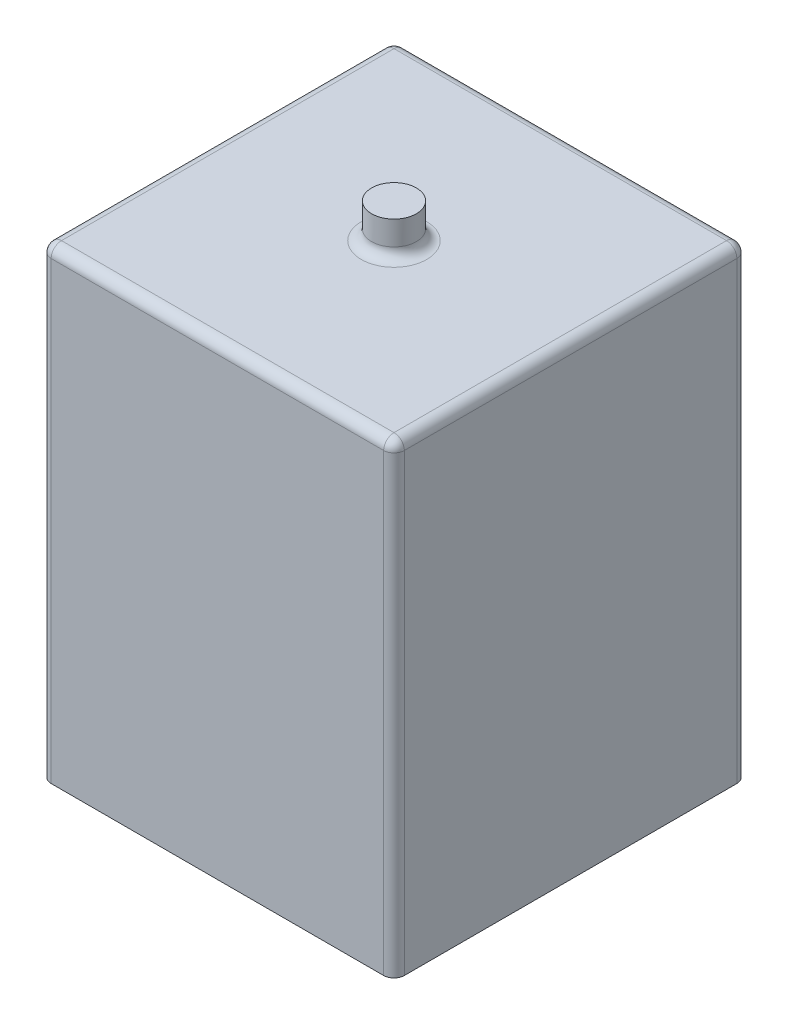
ISO-10303-21;
HEADER;
FILE_DESCRIPTION(('STEP AP214'),'2;1');
FILE_NAME('part.step','',(''),(''),'','','');
FILE_SCHEMA(('AUTOMOTIVE_DESIGN { 1 0 10303 214 1 1 1 1 }'));
ENDSEC;
DATA;
#1=APPLICATION_CONTEXT('core data for automotive mechanical design processes');
#2=APPLICATION_PROTOCOL_DEFINITION('international standard','automotive_design',2000,#1);
#3=PRODUCT_CONTEXT('',#1,'mechanical');
#4=PRODUCT('Part','Part','',(#3));
#5=PRODUCT_RELATED_PRODUCT_CATEGORY('part','',(#4));
#6=PRODUCT_DEFINITION_FORMATION('','',#4);
#7=PRODUCT_DEFINITION_CONTEXT('part definition',#1,'design');
#8=PRODUCT_DEFINITION('design','',#6,#7);
#9=PRODUCT_DEFINITION_SHAPE('','',#8);
#10=(LENGTH_UNIT() NAMED_UNIT(*) SI_UNIT(.MILLI.,.METRE.));
#11=(NAMED_UNIT(*) PLANE_ANGLE_UNIT() SI_UNIT($,.RADIAN.));
#12=(NAMED_UNIT(*) SI_UNIT($,.STERADIAN.) SOLID_ANGLE_UNIT());
#13=UNCERTAINTY_MEASURE_WITH_UNIT(LENGTH_MEASURE(1.E-05),#10,'distance_accuracy_value','');
#14=(GEOMETRIC_REPRESENTATION_CONTEXT(3) GLOBAL_UNCERTAINTY_ASSIGNED_CONTEXT((#13)) GLOBAL_UNIT_ASSIGNED_CONTEXT((#10,
#11,#12)) REPRESENTATION_CONTEXT('',''));
#15=CARTESIAN_POINT('',(0.,0.,0.));
#16=DIRECTION('',(0.,0.,1.));
#17=DIRECTION('',(1.,0.,0.));
#18=AXIS2_PLACEMENT_3D('',#15,#16,#17);
#19=CARTESIAN_POINT('',(5.12652416360247,13.5,5.12652416360247));
#20=DIRECTION('',(-1.,0.,0.));
#21=DIRECTION('',(0.,0.,1.));
#22=AXIS2_PLACEMENT_3D('',#19,#20,#21);
#23=PLANE('',#22);
#24=DIRECTION('',(0.,0.,-1.));
#25=VECTOR('',#24,1.);
#26=CARTESIAN_POINT('',(5.12652416360247,0.,5.12652416360247));
#27=LINE('',#26,#25);
#28=CARTESIAN_POINT('',(5.12652416360247,0.,4.82652416360247));
#29=VERTEX_POINT('',#28);
#30=CARTESIAN_POINT('',(5.12652416360247,0.,-4.82652416360247));
#31=VERTEX_POINT('',#30);
#32=EDGE_CURVE('E205',#29,#31,#27,.T.);
#33=ORIENTED_EDGE('',*,*,#32,.T.);
#34=DIRECTION('',(0.,-1.,0.));
#35=VECTOR('',#34,1.);
#36=CARTESIAN_POINT('',(5.12652416360247,13.5,-4.82652416360247));
#37=LINE('',#36,#35);
#38=CARTESIAN_POINT('',(5.12652416360247,13.2,-4.82652416360247));
#39=VERTEX_POINT('',#38);
#40=EDGE_CURVE('E50',#31,#39,#37,.F.);
#41=ORIENTED_EDGE('',*,*,#40,.T.);
#42=DIRECTION('',(0.,0.,-1.));
#43=VECTOR('',#42,1.);
#44=CARTESIAN_POINT('',(5.12652416360247,13.2,5.12652416360247));
#45=LINE('',#44,#43);
#46=CARTESIAN_POINT('',(5.12652416360247,13.2,4.82652416360247));
#47=VERTEX_POINT('',#46);
#48=EDGE_CURVE('E55',#39,#47,#45,.F.);
#49=ORIENTED_EDGE('',*,*,#48,.T.);
#50=DIRECTION('',(0.,-1.,0.));
#51=VECTOR('',#50,1.);
#52=CARTESIAN_POINT('',(5.12652416360247,13.5,4.82652416360247));
#53=LINE('',#52,#51);
#54=EDGE_CURVE('E168',#47,#29,#53,.T.);
#55=ORIENTED_EDGE('',*,*,#54,.T.);
#56=EDGE_LOOP('',(#33,#41,#49,#55));
#57=FACE_BOUND('',#56,.T.);
#58=ADVANCED_FACE('F33',(#57),#23,.F.);
#59=CARTESIAN_POINT('',(-5.12652416360247,13.5,-5.12652416360247));
#60=DIRECTION('',(0.,0.,1.));
#61=DIRECTION('',(1.,0.,0.));
#62=AXIS2_PLACEMENT_3D('',#59,#60,#61);
#63=PLANE('',#62);
#64=DIRECTION('',(-1.,0.,0.));
#65=VECTOR('',#64,1.);
#66=CARTESIAN_POINT('',(-5.12652416360247,0.,-5.12652416360247));
#67=LINE('',#66,#65);
#68=CARTESIAN_POINT('',(4.82652416360247,0.,-5.12652416360247));
#69=VERTEX_POINT('',#68);
#70=CARTESIAN_POINT('',(-4.82652416360247,0.,-5.12652416360247));
#71=VERTEX_POINT('',#70);
#72=EDGE_CURVE('E209',#69,#71,#67,.T.);
#73=ORIENTED_EDGE('',*,*,#72,.T.);
#74=DIRECTION('',(0.,-1.,0.));
#75=VECTOR('',#74,1.);
#76=CARTESIAN_POINT('',(-4.82652416360247,13.5,-5.12652416360247));
#77=LINE('',#76,#75);
#78=CARTESIAN_POINT('',(-4.82652416360247,13.2,-5.12652416360247));
#79=VERTEX_POINT('',#78);
#80=EDGE_CURVE('E166',#71,#79,#77,.F.);
#81=ORIENTED_EDGE('',*,*,#80,.T.);
#82=DIRECTION('',(-1.,0.,0.));
#83=VECTOR('',#82,1.);
#84=CARTESIAN_POINT('',(-5.12652416360247,13.2,-5.12652416360247));
#85=LINE('',#84,#83);
#86=CARTESIAN_POINT('',(4.82652416360247,13.2,-5.12652416360247));
#87=VERTEX_POINT('',#86);
#88=EDGE_CURVE('E164',#79,#87,#85,.F.);
#89=ORIENTED_EDGE('',*,*,#88,.T.);
#90=DIRECTION('',(0.,-1.,0.));
#91=VECTOR('',#90,1.);
#92=CARTESIAN_POINT('',(4.82652416360247,13.5,-5.12652416360247));
#93=LINE('',#92,#91);
#94=EDGE_CURVE('E162',#87,#69,#93,.T.);
#95=ORIENTED_EDGE('',*,*,#94,.T.);
#96=EDGE_LOOP('',(#73,#81,#89,#95));
#97=FACE_BOUND('',#96,.T.);
#98=ADVANCED_FACE('F264',(#97),#63,.F.);
#99=CARTESIAN_POINT('',(-5.12652416360247,13.5,5.12652416360247));
#100=DIRECTION('',(1.,0.,0.));
#101=DIRECTION('',(0.,0.,-1.));
#102=AXIS2_PLACEMENT_3D('',#99,#100,#101);
#103=PLANE('',#102);
#104=DIRECTION('',(0.,0.,1.));
#105=VECTOR('',#104,1.);
#106=CARTESIAN_POINT('',(-5.12652416360247,0.,5.12652416360247));
#107=LINE('',#106,#105);
#108=CARTESIAN_POINT('',(-5.12652416360247,0.,-4.82652416360247));
#109=VERTEX_POINT('',#108);
#110=CARTESIAN_POINT('',(-5.12652416360247,0.,4.82652416360247));
#111=VERTEX_POINT('',#110);
#112=EDGE_CURVE('E214',#109,#111,#107,.T.);
#113=ORIENTED_EDGE('',*,*,#112,.T.);
#114=DIRECTION('',(0.,-1.,0.));
#115=VECTOR('',#114,1.);
#116=CARTESIAN_POINT('',(-5.12652416360247,13.5,4.82652416360247));
#117=LINE('',#116,#115);
#118=CARTESIAN_POINT('',(-5.12652416360247,13.2,4.82652416360247));
#119=VERTEX_POINT('',#118);
#120=EDGE_CURVE('E160',#111,#119,#117,.F.);
#121=ORIENTED_EDGE('',*,*,#120,.T.);
#122=DIRECTION('',(0.,0.,1.));
#123=VECTOR('',#122,1.);
#124=CARTESIAN_POINT('',(-5.12652416360247,13.2,5.12652416360247));
#125=LINE('',#124,#123);
#126=CARTESIAN_POINT('',(-5.12652416360247,13.2,-4.82652416360247));
#127=VERTEX_POINT('',#126);
#128=EDGE_CURVE('E158',#119,#127,#125,.F.);
#129=ORIENTED_EDGE('',*,*,#128,.T.);
#130=DIRECTION('',(0.,-1.,0.));
#131=VECTOR('',#130,1.);
#132=CARTESIAN_POINT('',(-5.12652416360247,13.5,-4.82652416360247));
#133=LINE('',#132,#131);
#134=EDGE_CURVE('E156',#127,#109,#133,.T.);
#135=ORIENTED_EDGE('',*,*,#134,.T.);
#136=EDGE_LOOP('',(#113,#121,#129,#135));
#137=FACE_BOUND('',#136,.T.);
#138=ADVANCED_FACE('F269',(#137),#103,.F.);
#139=CARTESIAN_POINT('',(-5.12652416360247,13.5,5.12652416360247));
#140=DIRECTION('',(0.,0.,-1.));
#141=DIRECTION('',(-1.,0.,0.));
#142=AXIS2_PLACEMENT_3D('',#139,#140,#141);
#143=PLANE('',#142);
#144=DIRECTION('',(1.,0.,0.));
#145=VECTOR('',#144,1.);
#146=CARTESIAN_POINT('',(-5.12652416360247,13.2,5.12652416360247));
#147=LINE('',#146,#145);
#148=CARTESIAN_POINT('',(4.82652416360247,13.2,5.12652416360247));
#149=VERTEX_POINT('',#148);
#150=CARTESIAN_POINT('',(-4.82652416360247,13.2,5.12652416360247));
#151=VERTEX_POINT('',#150);
#152=EDGE_CURVE('E118',#149,#151,#147,.F.);
#153=ORIENTED_EDGE('',*,*,#152,.T.);
#154=DIRECTION('',(0.,-1.,0.));
#155=VECTOR('',#154,1.);
#156=CARTESIAN_POINT('',(-4.82652416360247,13.5,5.12652416360247));
#157=LINE('',#156,#155);
#158=CARTESIAN_POINT('',(-4.82652416360247,0.,5.12652416360247));
#159=VERTEX_POINT('',#158);
#160=EDGE_CURVE('E154',#151,#159,#157,.T.);
#161=ORIENTED_EDGE('',*,*,#160,.T.);
#162=DIRECTION('',(1.,0.,0.));
#163=VECTOR('',#162,1.);
#164=CARTESIAN_POINT('',(-5.12652416360247,0.,5.12652416360247));
#165=LINE('',#164,#163);
#166=CARTESIAN_POINT('',(4.82652416360247,0.,5.12652416360247));
#167=VERTEX_POINT('',#166);
#168=EDGE_CURVE('E217',#159,#167,#165,.T.);
#169=ORIENTED_EDGE('',*,*,#168,.T.);
#170=DIRECTION('',(0.,-1.,0.));
#171=VECTOR('',#170,1.);
#172=CARTESIAN_POINT('',(4.82652416360247,13.5,5.12652416360247));
#173=LINE('',#172,#171);
#174=EDGE_CURVE('E147',#167,#149,#173,.F.);
#175=ORIENTED_EDGE('',*,*,#174,.T.);
#176=EDGE_LOOP('',(#153,#161,#169,#175));
#177=FACE_BOUND('',#176,.T.);
#178=ADVANCED_FACE('F240',(#177),#143,.F.);
#179=CARTESIAN_POINT('',(0.,13.5,0.));
#180=DIRECTION('',(0.,-1.,0.));
#181=DIRECTION('',(0.,0.,-1.));
#182=AXIS2_PLACEMENT_3D('',#179,#180,#181);
#183=PLANE('',#182);
#184=DIRECTION('',(0.,0.,1.));
#185=VECTOR('',#184,1.);
#186=CARTESIAN_POINT('',(-4.82652416360247,13.5,0.));
#187=LINE('',#186,#185);
#188=CARTESIAN_POINT('',(-4.82652416360247,13.5,-4.82652416360247));
#189=VERTEX_POINT('',#188);
#190=CARTESIAN_POINT('',(-4.82652416360247,13.5,4.82652416360247));
#191=VERTEX_POINT('',#190);
#192=EDGE_CURVE('E145',#189,#191,#187,.T.);
#193=ORIENTED_EDGE('',*,*,#192,.T.);
#194=DIRECTION('',(1.,0.,0.));
#195=VECTOR('',#194,1.);
#196=CARTESIAN_POINT('',(0.,13.5,4.82652416360247));
#197=LINE('',#196,#195);
#198=CARTESIAN_POINT('',(4.82652416360247,13.5,4.82652416360247));
#199=VERTEX_POINT('',#198);
#200=EDGE_CURVE('E116',#191,#199,#197,.T.);
#201=ORIENTED_EDGE('',*,*,#200,.T.);
#202=DIRECTION('',(0.,0.,-1.));
#203=VECTOR('',#202,1.);
#204=CARTESIAN_POINT('',(4.82652416360247,13.5,0.));
#205=LINE('',#204,#203);
#206=CARTESIAN_POINT('',(4.82652416360247,13.5,-4.82652416360247));
#207=VERTEX_POINT('',#206);
#208=EDGE_CURVE('E133',#199,#207,#205,.T.);
#209=ORIENTED_EDGE('',*,*,#208,.T.);
#210=DIRECTION('',(-1.,0.,0.));
#211=VECTOR('',#210,1.);
#212=CARTESIAN_POINT('',(0.,13.5,-4.82652416360247));
#213=LINE('',#212,#211);
#214=EDGE_CURVE('E139',#207,#189,#213,.T.);
#215=ORIENTED_EDGE('',*,*,#214,.T.);
#216=EDGE_LOOP('',(#193,#201,#209,#215));
#217=FACE_BOUND('',#216,.T.);
#218=CARTESIAN_POINT('',(0.,13.5,0.));
#219=DIRECTION('',(0.,-1.,0.));
#220=DIRECTION('',(0.,0.,-1.));
#221=AXIS2_PLACEMENT_3D('',#218,#219,#220);
#222=CIRCLE('',#221,0.95);
#223=CARTESIAN_POINT('',(0.,13.5,-0.95));
#224=VERTEX_POINT('',#223);
#225=EDGE_CURVE('E140',#224,#224,#222,.T.);
#226=ORIENTED_EDGE('',*,*,#225,.T.);
#227=EDGE_LOOP('',(#226));
#228=FACE_BOUND('',#227,.T.);
#229=ADVANCED_FACE('F142',(#217,#228),#183,.F.);
#230=CARTESIAN_POINT('',(0.,0.,0.));
#231=DIRECTION('',(0.,-1.,0.));
#232=DIRECTION('',(0.,0.,-1.));
#233=AXIS2_PLACEMENT_3D('',#230,#231,#232);
#234=PLANE('',#233);
#235=ORIENTED_EDGE('',*,*,#168,.F.);
#236=CARTESIAN_POINT('',(-4.82652416360247,0.,4.82652416360247));
#237=DIRECTION('',(0.,-1.,0.));
#238=DIRECTION('',(0.,0.,-1.));
#239=AXIS2_PLACEMENT_3D('',#236,#237,#238);
#240=CIRCLE('',#239,0.3);
#241=EDGE_CURVE('E11',#159,#111,#240,.T.);
#242=ORIENTED_EDGE('',*,*,#241,.T.);
#243=ORIENTED_EDGE('',*,*,#112,.F.);
#244=CARTESIAN_POINT('',(-4.82652416360247,0.,-4.82652416360247));
#245=DIRECTION('',(0.,-1.,0.));
#246=DIRECTION('',(0.,0.,-1.));
#247=AXIS2_PLACEMENT_3D('',#244,#245,#246);
#248=CIRCLE('',#247,0.3);
#249=EDGE_CURVE('E42',#109,#71,#248,.T.);
#250=ORIENTED_EDGE('',*,*,#249,.T.);
#251=ORIENTED_EDGE('',*,*,#72,.F.);
#252=CARTESIAN_POINT('',(4.82652416360247,0.,-4.82652416360247));
#253=DIRECTION('',(0.,-1.,0.));
#254=DIRECTION('',(0.,0.,-1.));
#255=AXIS2_PLACEMENT_3D('',#252,#253,#254);
#256=CIRCLE('',#255,0.3);
#257=EDGE_CURVE('E177',#69,#31,#256,.T.);
#258=ORIENTED_EDGE('',*,*,#257,.T.);
#259=ORIENTED_EDGE('',*,*,#32,.F.);
#260=CARTESIAN_POINT('',(4.82652416360247,0.,4.82652416360247));
#261=DIRECTION('',(0.,-1.,0.));
#262=DIRECTION('',(0.,0.,-1.));
#263=AXIS2_PLACEMENT_3D('',#260,#261,#262);
#264=CIRCLE('',#263,0.3);
#265=EDGE_CURVE('E175',#29,#167,#264,.T.);
#266=ORIENTED_EDGE('',*,*,#265,.T.);
#267=EDGE_LOOP('',(#235,#242,#243,#250,#251,#258,#259,#266));
#268=FACE_BOUND('',#267,.T.);
#269=ADVANCED_FACE('F247',(#268),#234,.T.);
#270=CARTESIAN_POINT('',(0.,14.5,0.));
#271=DIRECTION('',(0.,-1.,0.));
#272=DIRECTION('',(0.,0.,-1.));
#273=AXIS2_PLACEMENT_3D('',#270,#271,#272);
#274=CYLINDRICAL_SURFACE('',#273,0.65);
#275=CARTESIAN_POINT('',(0.,13.8,0.));
#276=DIRECTION('',(0.,-1.,0.));
#277=DIRECTION('',(0.,0.,-1.));
#278=AXIS2_PLACEMENT_3D('',#275,#276,#277);
#279=CIRCLE('',#278,0.65);
#280=CARTESIAN_POINT('',(0.,13.8,-0.65));
#281=VERTEX_POINT('',#280);
#282=EDGE_CURVE('E172',#281,#281,#279,.F.);
#283=ORIENTED_EDGE('',*,*,#282,.T.);
#284=EDGE_LOOP('',(#283));
#285=FACE_BOUND('',#284,.T.);
#286=CARTESIAN_POINT('',(0.,14.5,0.));
#287=DIRECTION('',(0.,1.,0.));
#288=DIRECTION('',(0.,0.,1.));
#289=AXIS2_PLACEMENT_3D('',#286,#287,#288);
#290=CIRCLE('',#289,0.65);
#291=CARTESIAN_POINT('',(0.,14.5,0.65));
#292=VERTEX_POINT('',#291);
#293=EDGE_CURVE('E202',#292,#292,#290,.T.);
#294=ORIENTED_EDGE('',*,*,#293,.F.);
#295=EDGE_LOOP('',(#294));
#296=FACE_BOUND('',#295,.T.);
#297=ADVANCED_FACE('F374',(#285,#296),#274,.T.);
#298=CARTESIAN_POINT('',(0.,14.5,0.));
#299=DIRECTION('',(0.,1.,0.));
#300=DIRECTION('',(0.,0.,1.));
#301=AXIS2_PLACEMENT_3D('',#298,#299,#300);
#302=PLANE('',#301);
#303=ORIENTED_EDGE('',*,*,#293,.T.);
#304=EDGE_LOOP('',(#303));
#305=FACE_BOUND('',#304,.T.);
#306=ADVANCED_FACE('F365',(#305),#302,.T.);
#307=CARTESIAN_POINT('',(-4.82652416360247,13.5,-4.82652416360247));
#308=DIRECTION('',(0.,-1.,0.));
#309=DIRECTION('',(0.,0.,-1.));
#310=AXIS2_PLACEMENT_3D('',#307,#308,#309);
#311=CYLINDRICAL_SURFACE('',#310,0.3);
#312=ORIENTED_EDGE('',*,*,#249,.F.);
#313=ORIENTED_EDGE('',*,*,#134,.F.);
#314=CARTESIAN_POINT('',(-4.82652416360247,13.2,-4.82652416360247));
#315=DIRECTION('',(0.,1.,0.));
#316=DIRECTION('',(0.,0.,1.));
#317=AXIS2_PLACEMENT_3D('',#314,#315,#316);
#318=CIRCLE('',#317,0.3);
#319=EDGE_CURVE('E37',#79,#127,#318,.T.);
#320=ORIENTED_EDGE('',*,*,#319,.F.);
#321=ORIENTED_EDGE('',*,*,#80,.F.);
#322=EDGE_LOOP('',(#312,#313,#320,#321));
#323=FACE_BOUND('',#322,.T.);
#324=ADVANCED_FACE('F357',(#323),#311,.T.);
#325=CARTESIAN_POINT('',(0.,13.2,-4.82652416360247));
#326=DIRECTION('',(-1.,0.,0.));
#327=DIRECTION('',(0.,0.,1.));
#328=AXIS2_PLACEMENT_3D('',#325,#326,#327);
#329=CYLINDRICAL_SURFACE('',#328,0.3);
#330=CARTESIAN_POINT('',(4.82652416360247,13.2,-4.82652416360247));
#331=DIRECTION('',(1.,0.,0.));
#332=DIRECTION('',(0.,0.,-1.));
#333=AXIS2_PLACEMENT_3D('',#330,#331,#332);
#334=CIRCLE('',#333,0.3);
#335=EDGE_CURVE('E194',#87,#207,#334,.T.);
#336=ORIENTED_EDGE('',*,*,#335,.F.);
#337=ORIENTED_EDGE('',*,*,#88,.F.);
#338=CARTESIAN_POINT('',(-4.82652416360247,13.2,-4.82652416360247));
#339=DIRECTION('',(-1.,0.,0.));
#340=DIRECTION('',(0.,0.,1.));
#341=AXIS2_PLACEMENT_3D('',#338,#339,#340);
#342=CIRCLE('',#341,0.3);
#343=EDGE_CURVE('E196',#189,#79,#342,.T.);
#344=ORIENTED_EDGE('',*,*,#343,.F.);
#345=ORIENTED_EDGE('',*,*,#214,.F.);
#346=EDGE_LOOP('',(#336,#337,#344,#345));
#347=FACE_BOUND('',#346,.T.);
#348=ADVANCED_FACE('F224',(#347),#329,.T.);
#349=CARTESIAN_POINT('',(4.82652416360247,13.5,-4.82652416360247));
#350=DIRECTION('',(0.,-1.,0.));
#351=DIRECTION('',(0.,0.,-1.));
#352=AXIS2_PLACEMENT_3D('',#349,#350,#351);
#353=CYLINDRICAL_SURFACE('',#352,0.3);
#354=ORIENTED_EDGE('',*,*,#257,.F.);
#355=ORIENTED_EDGE('',*,*,#94,.F.);
#356=CARTESIAN_POINT('',(4.82652416360247,13.2,-4.82652416360247));
#357=DIRECTION('',(0.,1.,0.));
#358=DIRECTION('',(0.,0.,1.));
#359=AXIS2_PLACEMENT_3D('',#356,#357,#358);
#360=CIRCLE('',#359,0.3);
#361=EDGE_CURVE('E191',#39,#87,#360,.T.);
#362=ORIENTED_EDGE('',*,*,#361,.F.);
#363=ORIENTED_EDGE('',*,*,#40,.F.);
#364=EDGE_LOOP('',(#354,#355,#362,#363));
#365=FACE_BOUND('',#364,.T.);
#366=ADVANCED_FACE('F252',(#365),#353,.T.);
#367=CARTESIAN_POINT('',(-4.82652416360247,13.2,-4.82652416360247));
#368=DIRECTION('',(0.,0.,1.));
#369=DIRECTION('',(1.,0.,0.));
#370=AXIS2_PLACEMENT_3D('',#367,#368,#369);
#371=SPHERICAL_SURFACE('',#370,0.3);
#372=ORIENTED_EDGE('',*,*,#343,.T.);
#373=ORIENTED_EDGE('',*,*,#319,.T.);
#374=CARTESIAN_POINT('',(-4.82652416360247,13.2,-4.82652416360247));
#375=DIRECTION('',(0.,0.,-1.));
#376=DIRECTION('',(-1.,0.,0.));
#377=AXIS2_PLACEMENT_3D('',#374,#375,#376);
#378=CIRCLE('',#377,0.3);
#379=EDGE_CURVE('E188',#189,#127,#378,.F.);
#380=ORIENTED_EDGE('',*,*,#379,.F.);
#381=EDGE_LOOP('',(#372,#373,#380));
#382=FACE_BOUND('',#381,.T.);
#383=ADVANCED_FACE('F225',(#382),#371,.T.);
#384=CARTESIAN_POINT('',(4.82652416360247,13.2,-4.82652416360247));
#385=DIRECTION('',(0.,0.,1.));
#386=DIRECTION('',(1.,0.,0.));
#387=AXIS2_PLACEMENT_3D('',#384,#385,#386);
#388=SPHERICAL_SURFACE('',#387,0.3);
#389=ORIENTED_EDGE('',*,*,#361,.T.);
#390=ORIENTED_EDGE('',*,*,#335,.T.);
#391=CARTESIAN_POINT('',(4.82652416360247,13.2,-4.82652416360247));
#392=DIRECTION('',(0.,0.,-1.));
#393=DIRECTION('',(-1.,0.,0.));
#394=AXIS2_PLACEMENT_3D('',#391,#392,#393);
#395=CIRCLE('',#394,0.3);
#396=EDGE_CURVE('E136',#39,#207,#395,.F.);
#397=ORIENTED_EDGE('',*,*,#396,.F.);
#398=EDGE_LOOP('',(#389,#390,#397));
#399=FACE_BOUND('',#398,.T.);
#400=ADVANCED_FACE('F254',(#399),#388,.T.);
#401=CARTESIAN_POINT('',(-4.82652416360247,13.5,4.82652416360247));
#402=DIRECTION('',(0.,-1.,0.));
#403=DIRECTION('',(0.,0.,-1.));
#404=AXIS2_PLACEMENT_3D('',#401,#402,#403);
#405=CYLINDRICAL_SURFACE('',#404,0.3);
#406=ORIENTED_EDGE('',*,*,#241,.F.);
#407=ORIENTED_EDGE('',*,*,#160,.F.);
#408=CARTESIAN_POINT('',(-4.82652416360247,13.2,4.82652416360247));
#409=DIRECTION('',(0.,1.,0.));
#410=DIRECTION('',(0.,0.,1.));
#411=AXIS2_PLACEMENT_3D('',#408,#409,#410);
#412=CIRCLE('',#411,0.3);
#413=EDGE_CURVE('E184',#119,#151,#412,.T.);
#414=ORIENTED_EDGE('',*,*,#413,.F.);
#415=ORIENTED_EDGE('',*,*,#120,.F.);
#416=EDGE_LOOP('',(#406,#407,#414,#415));
#417=FACE_BOUND('',#416,.T.);
#418=ADVANCED_FACE('F237',(#417),#405,.T.);
#419=CARTESIAN_POINT('',(-4.82652416360247,13.2,0.));
#420=DIRECTION('',(0.,0.,1.));
#421=DIRECTION('',(1.,0.,0.));
#422=AXIS2_PLACEMENT_3D('',#419,#420,#421);
#423=CYLINDRICAL_SURFACE('',#422,0.3);
#424=ORIENTED_EDGE('',*,*,#379,.T.);
#425=ORIENTED_EDGE('',*,*,#128,.F.);
#426=CARTESIAN_POINT('',(-4.82652416360247,13.2,4.82652416360247));
#427=DIRECTION('',(0.,0.,1.));
#428=DIRECTION('',(1.,0.,0.));
#429=AXIS2_PLACEMENT_3D('',#426,#427,#428);
#430=CIRCLE('',#429,0.3);
#431=EDGE_CURVE('E130',#191,#119,#430,.T.);
#432=ORIENTED_EDGE('',*,*,#431,.F.);
#433=ORIENTED_EDGE('',*,*,#192,.F.);
#434=EDGE_LOOP('',(#424,#425,#432,#433));
#435=FACE_BOUND('',#434,.T.);
#436=ADVANCED_FACE('F228',(#435),#423,.T.);
#437=CARTESIAN_POINT('',(4.82652416360247,13.2,0.));
#438=DIRECTION('',(0.,0.,-1.));
#439=DIRECTION('',(-1.,0.,0.));
#440=AXIS2_PLACEMENT_3D('',#437,#438,#439);
#441=CYLINDRICAL_SURFACE('',#440,0.3);
#442=ORIENTED_EDGE('',*,*,#396,.T.);
#443=ORIENTED_EDGE('',*,*,#208,.F.);
#444=CARTESIAN_POINT('',(4.82652416360247,13.2,4.82652416360247));
#445=DIRECTION('',(0.,0.,1.));
#446=DIRECTION('',(1.,0.,0.));
#447=AXIS2_PLACEMENT_3D('',#444,#445,#446);
#448=CIRCLE('',#447,0.3);
#449=EDGE_CURVE('E124',#47,#199,#448,.T.);
#450=ORIENTED_EDGE('',*,*,#449,.F.);
#451=ORIENTED_EDGE('',*,*,#48,.F.);
#452=EDGE_LOOP('',(#442,#443,#450,#451));
#453=FACE_BOUND('',#452,.T.);
#454=ADVANCED_FACE('F134',(#453),#441,.T.);
#455=CARTESIAN_POINT('',(4.82652416360247,13.5,4.82652416360247));
#456=DIRECTION('',(0.,-1.,0.));
#457=DIRECTION('',(0.,0.,-1.));
#458=AXIS2_PLACEMENT_3D('',#455,#456,#457);
#459=CYLINDRICAL_SURFACE('',#458,0.3);
#460=ORIENTED_EDGE('',*,*,#265,.F.);
#461=ORIENTED_EDGE('',*,*,#54,.F.);
#462=CARTESIAN_POINT('',(4.82652416360247,13.2,4.82652416360247));
#463=DIRECTION('',(0.,1.,0.));
#464=DIRECTION('',(0.,0.,1.));
#465=AXIS2_PLACEMENT_3D('',#462,#463,#464);
#466=CIRCLE('',#465,0.3);
#467=EDGE_CURVE('E128',#149,#47,#466,.T.);
#468=ORIENTED_EDGE('',*,*,#467,.F.);
#469=ORIENTED_EDGE('',*,*,#174,.F.);
#470=EDGE_LOOP('',(#460,#461,#468,#469));
#471=FACE_BOUND('',#470,.T.);
#472=ADVANCED_FACE('F244',(#471),#459,.T.);
#473=CARTESIAN_POINT('',(-4.82652416360247,13.2,4.82652416360247));
#474=DIRECTION('',(0.,0.,1.));
#475=DIRECTION('',(1.,0.,0.));
#476=AXIS2_PLACEMENT_3D('',#473,#474,#475);
#477=SPHERICAL_SURFACE('',#476,0.3);
#478=ORIENTED_EDGE('',*,*,#431,.T.);
#479=ORIENTED_EDGE('',*,*,#413,.T.);
#480=CARTESIAN_POINT('',(-4.82652416360247,13.2,4.82652416360247));
#481=DIRECTION('',(-1.,0.,0.));
#482=DIRECTION('',(0.,0.,1.));
#483=AXIS2_PLACEMENT_3D('',#480,#481,#482);
#484=CIRCLE('',#483,0.3);
#485=EDGE_CURVE('E121',#191,#151,#484,.F.);
#486=ORIENTED_EDGE('',*,*,#485,.F.);
#487=EDGE_LOOP('',(#478,#479,#486));
#488=FACE_BOUND('',#487,.T.);
#489=ADVANCED_FACE('F232',(#488),#477,.T.);
#490=CARTESIAN_POINT('',(4.82652416360247,13.2,4.82652416360247));
#491=DIRECTION('',(0.,0.,1.));
#492=DIRECTION('',(1.,0.,0.));
#493=AXIS2_PLACEMENT_3D('',#490,#491,#492);
#494=SPHERICAL_SURFACE('',#493,0.3);
#495=ORIENTED_EDGE('',*,*,#467,.T.);
#496=ORIENTED_EDGE('',*,*,#449,.T.);
#497=CARTESIAN_POINT('',(4.82652416360247,13.2,4.82652416360247));
#498=DIRECTION('',(1.,0.,0.));
#499=DIRECTION('',(0.,0.,-1.));
#500=AXIS2_PLACEMENT_3D('',#497,#498,#499);
#501=CIRCLE('',#500,0.3);
#502=EDGE_CURVE('E112',#149,#199,#501,.F.);
#503=ORIENTED_EDGE('',*,*,#502,.F.);
#504=EDGE_LOOP('',(#495,#496,#503));
#505=FACE_BOUND('',#504,.T.);
#506=ADVANCED_FACE('F126',(#505),#494,.T.);
#507=CARTESIAN_POINT('',(0.,13.2,4.82652416360247));
#508=DIRECTION('',(1.,0.,0.));
#509=DIRECTION('',(0.,0.,-1.));
#510=AXIS2_PLACEMENT_3D('',#507,#508,#509);
#511=CYLINDRICAL_SURFACE('',#510,0.3);
#512=ORIENTED_EDGE('',*,*,#485,.T.);
#513=ORIENTED_EDGE('',*,*,#152,.F.);
#514=ORIENTED_EDGE('',*,*,#502,.T.);
#515=ORIENTED_EDGE('',*,*,#200,.F.);
#516=EDGE_LOOP('',(#512,#513,#514,#515));
#517=FACE_BOUND('',#516,.T.);
#518=ADVANCED_FACE('F114',(#517),#511,.T.);
#519=CARTESIAN_POINT('',(0.,13.8,0.));
#520=DIRECTION('',(0.,-1.,0.));
#521=DIRECTION('',(0.,0.,-1.));
#522=AXIS2_PLACEMENT_3D('',#519,#520,#521);
#523=TOROIDAL_SURFACE('',#522,0.95,0.3);
#524=ORIENTED_EDGE('',*,*,#225,.F.);
#525=EDGE_LOOP('',(#524));
#526=FACE_BOUND('',#525,.T.);
#527=ORIENTED_EDGE('',*,*,#282,.F.);
#528=EDGE_LOOP('',(#527));
#529=FACE_BOUND('',#528,.T.);
#530=ADVANCED_FACE('F35',(#526,#529),#523,.F.);
#531=CLOSED_SHELL('',(#58,#98,#138,#178,#229,#269,#297,#306,#324,#348,#366,#383,#400,#418,#436,
#454,#472,#489,#506,#518,#530));
#532=MANIFOLD_SOLID_BREP('B2',#531);
#533=ADVANCED_BREP_SHAPE_REPRESENTATION('',(#18,#532),#14);
#534=SHAPE_DEFINITION_REPRESENTATION(#9,#533);
ENDSEC;
END-ISO-10303-21;
